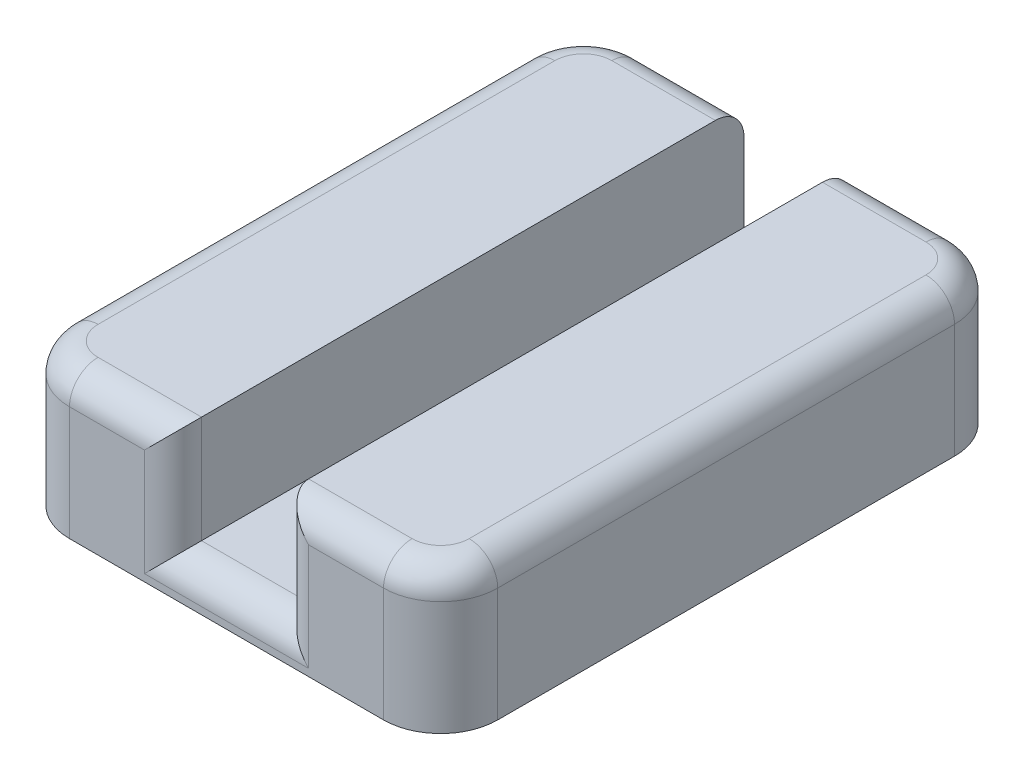
ISO-10303-21;
HEADER;
FILE_DESCRIPTION(('STEP AP214'),'2;1');
FILE_NAME('part.step','',(''),(''),'','','');
FILE_SCHEMA(('AUTOMOTIVE_DESIGN { 1 0 10303 214 1 1 1 1 }'));
ENDSEC;
DATA;
#1=APPLICATION_CONTEXT('core data for automotive mechanical design processes');
#2=APPLICATION_PROTOCOL_DEFINITION('international standard','automotive_design',2000,#1);
#3=PRODUCT_CONTEXT('',#1,'mechanical');
#4=PRODUCT('Part','Part','',(#3));
#5=PRODUCT_RELATED_PRODUCT_CATEGORY('part','',(#4));
#6=PRODUCT_DEFINITION_FORMATION('','',#4);
#7=PRODUCT_DEFINITION_CONTEXT('part definition',#1,'design');
#8=PRODUCT_DEFINITION('design','',#6,#7);
#9=PRODUCT_DEFINITION_SHAPE('','',#8);
#10=(LENGTH_UNIT() NAMED_UNIT(*) SI_UNIT(.MILLI.,.METRE.));
#11=(NAMED_UNIT(*) PLANE_ANGLE_UNIT() SI_UNIT($,.RADIAN.));
#12=(NAMED_UNIT(*) SI_UNIT($,.STERADIAN.) SOLID_ANGLE_UNIT());
#13=UNCERTAINTY_MEASURE_WITH_UNIT(LENGTH_MEASURE(1.E-05),#10,'distance_accuracy_value','');
#14=(GEOMETRIC_REPRESENTATION_CONTEXT(3) GLOBAL_UNCERTAINTY_ASSIGNED_CONTEXT((#13)) GLOBAL_UNIT_ASSIGNED_CONTEXT((#10,
#11,#12)) REPRESENTATION_CONTEXT('',''));
#15=CARTESIAN_POINT('',(0.,0.,0.));
#16=DIRECTION('',(0.,0.,1.));
#17=DIRECTION('',(1.,0.,0.));
#18=AXIS2_PLACEMENT_3D('',#15,#16,#17);
#19=CARTESIAN_POINT('',(7.14375,6.35,-19.05));
#20=DIRECTION('',(0.,0.,-1.));
#21=DIRECTION('',(-1.,0.,0.));
#22=AXIS2_PLACEMENT_3D('',#19,#20,#21);
#23=PLANE('',#22);
#24=DIRECTION('',(0.,-1.,0.));
#25=VECTOR('',#24,1.);
#26=CARTESIAN_POINT('',(7.14375,6.35,-19.05));
#27=LINE('',#26,#25);
#28=CARTESIAN_POINT('',(7.14375,0.317499999999999,-19.05));
#29=VERTEX_POINT('',#28);
#30=CARTESIAN_POINT('',(7.14375,0.,-19.05));
#31=VERTEX_POINT('',#30);
#32=EDGE_CURVE('E287',#29,#31,#27,.T.);
#33=ORIENTED_EDGE('',*,*,#32,.F.);
#34=DIRECTION('',(-1.,0.,0.));
#35=VECTOR('',#34,1.);
#36=CARTESIAN_POINT('',(7.14375,0.317499999999999,-19.05));
#37=LINE('',#36,#35);
#38=CARTESIAN_POINT('',(11.90625,0.317499999999999,-19.05));
#39=VERTEX_POINT('',#38);
#40=EDGE_CURVE('E383',#29,#39,#37,.F.);
#41=ORIENTED_EDGE('',*,*,#40,.T.);
#42=DIRECTION('',(0.,-1.,0.));
#43=VECTOR('',#42,1.);
#44=CARTESIAN_POINT('',(11.90625,6.35,-19.05));
#45=LINE('',#44,#43);
#46=CARTESIAN_POINT('',(11.90625,0.,-19.05));
#47=VERTEX_POINT('',#46);
#48=EDGE_CURVE('E284',#39,#47,#45,.T.);
#49=ORIENTED_EDGE('',*,*,#48,.T.);
#50=DIRECTION('',(1.,0.,0.));
#51=VECTOR('',#50,1.);
#52=CARTESIAN_POINT('',(7.14375,0.,-19.05));
#53=LINE('',#52,#51);
#54=EDGE_CURVE('E238',#31,#47,#53,.T.);
#55=ORIENTED_EDGE('',*,*,#54,.F.);
#56=EDGE_LOOP('',(#33,#41,#49,#55));
#57=FACE_BOUND('',#56,.T.);
#58=ADVANCED_FACE('F39',(#57),#23,.T.);
#59=CARTESIAN_POINT('',(2.54,6.35,-2.54));
#60=DIRECTION('',(0.,-1.,0.));
#61=DIRECTION('',(0.,0.,-1.));
#62=AXIS2_PLACEMENT_3D('',#59,#60,#61);
#63=PLANE('',#62);
#64=DIRECTION('',(0.,0.,1.));
#65=VECTOR('',#64,1.);
#66=CARTESIAN_POINT('',(7.14375,6.35,-25.4));
#67=LINE('',#66,#65);
#68=CARTESIAN_POINT('',(7.14375,6.35,-24.13));
#69=VERTEX_POINT('',#68);
#70=CARTESIAN_POINT('',(7.14375,6.35,-1.27000000000001));
#71=VERTEX_POINT('',#70);
#72=EDGE_CURVE('E264',#69,#71,#67,.T.);
#73=ORIENTED_EDGE('',*,*,#72,.F.);
#74=DIRECTION('',(1.,0.,0.));
#75=VECTOR('',#74,1.);
#76=CARTESIAN_POINT('',(2.54,6.35,-24.13));
#77=LINE('',#76,#75);
#78=CARTESIAN_POINT('',(2.54,6.35,-24.13));
#79=VERTEX_POINT('',#78);
#80=EDGE_CURVE('E352',#69,#79,#77,.F.);
#81=ORIENTED_EDGE('',*,*,#80,.T.);
#82=CARTESIAN_POINT('',(2.54,6.35,-22.86));
#83=DIRECTION('',(0.,-1.,0.));
#84=DIRECTION('',(0.,0.,-1.));
#85=AXIS2_PLACEMENT_3D('',#82,#83,#84);
#86=CIRCLE('',#85,1.27);
#87=CARTESIAN_POINT('',(1.27,6.35,-22.86));
#88=VERTEX_POINT('',#87);
#89=EDGE_CURVE('E349',#79,#88,#86,.F.);
#90=ORIENTED_EDGE('',*,*,#89,.T.);
#91=DIRECTION('',(0.,0.,-1.));
#92=VECTOR('',#91,1.);
#93=CARTESIAN_POINT('',(1.27,6.35,-2.54000000000002));
#94=LINE('',#93,#92);
#95=CARTESIAN_POINT('',(1.27,6.35,-2.54000000000002));
#96=VERTEX_POINT('',#95);
#97=EDGE_CURVE('E346',#88,#96,#94,.F.);
#98=ORIENTED_EDGE('',*,*,#97,.T.);
#99=CARTESIAN_POINT('',(2.54,6.35,-2.54));
#100=DIRECTION('',(0.,-1.,0.));
#101=DIRECTION('',(0.,0.,-1.));
#102=AXIS2_PLACEMENT_3D('',#99,#100,#101);
#103=CIRCLE('',#102,1.27);
#104=CARTESIAN_POINT('',(2.54000000000001,6.35,-1.27));
#105=VERTEX_POINT('',#104);
#106=EDGE_CURVE('E343',#96,#105,#103,.F.);
#107=ORIENTED_EDGE('',*,*,#106,.T.);
#108=DIRECTION('',(1.,0.,0.));
#109=VECTOR('',#108,1.);
#110=CARTESIAN_POINT('',(2.54,6.35,-1.27));
#111=LINE('',#110,#109);
#112=EDGE_CURVE('E340',#105,#71,#111,.T.);
#113=ORIENTED_EDGE('',*,*,#112,.T.);
#114=EDGE_LOOP('',(#73,#81,#90,#98,#107,#113));
#115=FACE_BOUND('',#114,.T.);
#116=ADVANCED_FACE('F528',(#115),#63,.F.);
#117=CARTESIAN_POINT('',(2.54,6.35,-2.54));
#118=DIRECTION('',(0.,-1.,0.));
#119=DIRECTION('',(0.,0.,-1.));
#120=AXIS2_PLACEMENT_3D('',#117,#118,#119);
#121=CYLINDRICAL_SURFACE('',#120,2.54);
#122=DIRECTION('',(0.,-1.,0.));
#123=VECTOR('',#122,1.);
#124=CARTESIAN_POINT('',(2.54000000000002,6.35,0.));
#125=LINE('',#124,#123);
#126=CARTESIAN_POINT('',(2.54000000000002,5.08,0.));
#127=VERTEX_POINT('',#126);
#128=CARTESIAN_POINT('',(2.54000000000002,0.,0.));
#129=VERTEX_POINT('',#128);
#130=EDGE_CURVE('E265',#127,#129,#125,.T.);
#131=ORIENTED_EDGE('',*,*,#130,.F.);
#132=CARTESIAN_POINT('',(2.54,5.08,-2.54));
#133=DIRECTION('',(0.,-1.,0.));
#134=DIRECTION('',(0.,0.,-1.));
#135=AXIS2_PLACEMENT_3D('',#132,#133,#134);
#136=CIRCLE('',#135,2.54);
#137=CARTESIAN_POINT('',(0.,5.08,-2.54000000000002));
#138=VERTEX_POINT('',#137);
#139=EDGE_CURVE('E196',#127,#138,#136,.T.);
#140=ORIENTED_EDGE('',*,*,#139,.T.);
#141=DIRECTION('',(0.,-1.,0.));
#142=VECTOR('',#141,1.);
#143=CARTESIAN_POINT('',(0.,6.35,-2.54000000000002));
#144=LINE('',#143,#142);
#145=CARTESIAN_POINT('',(0.,0.,-2.54000000000002));
#146=VERTEX_POINT('',#145);
#147=EDGE_CURVE('E189',#138,#146,#144,.T.);
#148=ORIENTED_EDGE('',*,*,#147,.T.);
#149=CARTESIAN_POINT('',(2.54,0.,-2.54));
#150=DIRECTION('',(0.,-1.,0.));
#151=DIRECTION('',(0.,0.,-1.));
#152=AXIS2_PLACEMENT_3D('',#149,#150,#151);
#153=CIRCLE('',#152,2.54);
#154=EDGE_CURVE('E194',#129,#146,#153,.T.);
#155=ORIENTED_EDGE('',*,*,#154,.F.);
#156=EDGE_LOOP('',(#131,#140,#148,#155));
#157=FACE_BOUND('',#156,.T.);
#158=ADVANCED_FACE('F192',(#157),#121,.T.);
#159=CARTESIAN_POINT('',(2.54000000000002,6.35,0.));
#160=DIRECTION('',(0.,0.,-1.));
#161=DIRECTION('',(-1.,0.,0.));
#162=AXIS2_PLACEMENT_3D('',#159,#160,#161);
#163=PLANE('',#162);
#164=DIRECTION('',(0.,-1.,0.));
#165=VECTOR('',#164,1.);
#166=CARTESIAN_POINT('',(16.51,6.35,0.));
#167=LINE('',#166,#165);
#168=CARTESIAN_POINT('',(16.51,5.08,0.));
#169=VERTEX_POINT('',#168);
#170=CARTESIAN_POINT('',(16.51,0.,0.));
#171=VERTEX_POINT('',#170);
#172=EDGE_CURVE('E269',#169,#171,#167,.T.);
#173=ORIENTED_EDGE('',*,*,#172,.F.);
#174=DIRECTION('',(1.,0.,0.));
#175=VECTOR('',#174,1.);
#176=CARTESIAN_POINT('',(2.54000000000002,5.08,0.));
#177=LINE('',#176,#175);
#178=CARTESIAN_POINT('',(13.17625,5.08,0.));
#179=VERTEX_POINT('',#178);
#180=EDGE_CURVE('E57',#169,#179,#177,.F.);
#181=ORIENTED_EDGE('',*,*,#180,.T.);
#182=DIRECTION('',(0.,1.,0.));
#183=VECTOR('',#182,1.);
#184=CARTESIAN_POINT('',(13.17625,6.35,0.));
#185=LINE('',#184,#183);
#186=CARTESIAN_POINT('',(13.17625,0.317499999999999,0.));
#187=VERTEX_POINT('',#186);
#188=EDGE_CURVE('E61',#179,#187,#185,.F.);
#189=ORIENTED_EDGE('',*,*,#188,.T.);
#190=DIRECTION('',(1.,0.,0.));
#191=VECTOR('',#190,1.);
#192=CARTESIAN_POINT('',(7.14375,0.317499999999999,0.));
#193=LINE('',#192,#191);
#194=CARTESIAN_POINT('',(5.87375,0.317499999999999,0.));
#195=VERTEX_POINT('',#194);
#196=EDGE_CURVE('E376',#187,#195,#193,.F.);
#197=ORIENTED_EDGE('',*,*,#196,.T.);
#198=DIRECTION('',(0.,1.,0.));
#199=VECTOR('',#198,1.);
#200=CARTESIAN_POINT('',(5.87375,6.35,0.));
#201=LINE('',#200,#199);
#202=CARTESIAN_POINT('',(5.87375,5.08,0.));
#203=VERTEX_POINT('',#202);
#204=EDGE_CURVE('E373',#195,#203,#201,.T.);
#205=ORIENTED_EDGE('',*,*,#204,.T.);
#206=DIRECTION('',(1.,0.,0.));
#207=VECTOR('',#206,1.);
#208=CARTESIAN_POINT('',(2.54000000000002,5.08,0.));
#209=LINE('',#208,#207);
#210=EDGE_CURVE('E370',#203,#127,#209,.F.);
#211=ORIENTED_EDGE('',*,*,#210,.T.);
#212=ORIENTED_EDGE('',*,*,#130,.T.);
#213=DIRECTION('',(1.,0.,0.));
#214=VECTOR('',#213,1.);
#215=CARTESIAN_POINT('',(2.54000000000002,0.,0.));
#216=LINE('',#215,#214);
#217=EDGE_CURVE('E217',#129,#171,#216,.T.);
#218=ORIENTED_EDGE('',*,*,#217,.T.);
#219=EDGE_LOOP('',(#173,#181,#189,#197,#205,#211,#212,#218));
#220=FACE_BOUND('',#219,.T.);
#221=ADVANCED_FACE('F512',(#220),#163,.F.);
#222=CARTESIAN_POINT('',(16.51,6.35,-2.54));
#223=DIRECTION('',(0.,-1.,0.));
#224=DIRECTION('',(0.,0.,-1.));
#225=AXIS2_PLACEMENT_3D('',#222,#223,#224);
#226=CYLINDRICAL_SURFACE('',#225,2.54);
#227=DIRECTION('',(0.,-1.,0.));
#228=VECTOR('',#227,1.);
#229=CARTESIAN_POINT('',(19.05,6.35,-2.54000000000002));
#230=LINE('',#229,#228);
#231=CARTESIAN_POINT('',(19.05,5.08,-2.54000000000002));
#232=VERTEX_POINT('',#231);
#233=CARTESIAN_POINT('',(19.05,0.,-2.54000000000002));
#234=VERTEX_POINT('',#233);
#235=EDGE_CURVE('E272',#232,#234,#230,.T.);
#236=ORIENTED_EDGE('',*,*,#235,.F.);
#237=CARTESIAN_POINT('',(16.51,5.08,-2.54));
#238=DIRECTION('',(0.,-1.,0.));
#239=DIRECTION('',(0.,0.,-1.));
#240=AXIS2_PLACEMENT_3D('',#237,#238,#239);
#241=CIRCLE('',#240,2.54);
#242=EDGE_CURVE('E328',#232,#169,#241,.T.);
#243=ORIENTED_EDGE('',*,*,#242,.T.);
#244=ORIENTED_EDGE('',*,*,#172,.T.);
#245=CARTESIAN_POINT('',(16.51,0.,-2.54));
#246=DIRECTION('',(0.,1.,0.));
#247=DIRECTION('',(0.,0.,1.));
#248=AXIS2_PLACEMENT_3D('',#245,#246,#247);
#249=CIRCLE('',#248,2.54);
#250=EDGE_CURVE('E258',#171,#234,#249,.T.);
#251=ORIENTED_EDGE('',*,*,#250,.T.);
#252=EDGE_LOOP('',(#236,#243,#244,#251));
#253=FACE_BOUND('',#252,.T.);
#254=ADVANCED_FACE('F593',(#253),#226,.T.);
#255=CARTESIAN_POINT('',(19.05,6.35,-2.54000000000002));
#256=DIRECTION('',(-1.,0.,0.));
#257=DIRECTION('',(0.,0.,1.));
#258=AXIS2_PLACEMENT_3D('',#255,#256,#257);
#259=PLANE('',#258);
#260=DIRECTION('',(0.,-1.,0.));
#261=VECTOR('',#260,1.);
#262=CARTESIAN_POINT('',(19.05,6.35,-22.86));
#263=LINE('',#262,#261);
#264=CARTESIAN_POINT('',(19.05,5.08,-22.86));
#265=VERTEX_POINT('',#264);
#266=CARTESIAN_POINT('',(19.05,0.,-22.86));
#267=VERTEX_POINT('',#266);
#268=EDGE_CURVE('E275',#265,#267,#263,.T.);
#269=ORIENTED_EDGE('',*,*,#268,.F.);
#270=DIRECTION('',(0.,0.,-1.));
#271=VECTOR('',#270,1.);
#272=CARTESIAN_POINT('',(19.05,5.08,-2.54000000000002));
#273=LINE('',#272,#271);
#274=EDGE_CURVE('E325',#265,#232,#273,.F.);
#275=ORIENTED_EDGE('',*,*,#274,.T.);
#276=ORIENTED_EDGE('',*,*,#235,.T.);
#277=DIRECTION('',(0.,0.,-1.));
#278=VECTOR('',#277,1.);
#279=CARTESIAN_POINT('',(19.05,0.,-2.54000000000002));
#280=LINE('',#279,#278);
#281=EDGE_CURVE('E254',#234,#267,#280,.T.);
#282=ORIENTED_EDGE('',*,*,#281,.T.);
#283=EDGE_LOOP('',(#269,#275,#276,#282));
#284=FACE_BOUND('',#283,.T.);
#285=ADVANCED_FACE('F596',(#284),#259,.F.);
#286=CARTESIAN_POINT('',(16.51,6.35,-22.86));
#287=DIRECTION('',(0.,-1.,0.));
#288=DIRECTION('',(0.,0.,-1.));
#289=AXIS2_PLACEMENT_3D('',#286,#287,#288);
#290=CYLINDRICAL_SURFACE('',#289,2.54);
#291=DIRECTION('',(0.,-1.,0.));
#292=VECTOR('',#291,1.);
#293=CARTESIAN_POINT('',(16.51,6.35,-25.4));
#294=LINE('',#293,#292);
#295=CARTESIAN_POINT('',(16.51,5.08,-25.4));
#296=VERTEX_POINT('',#295);
#297=CARTESIAN_POINT('',(16.51,0.,-25.4));
#298=VERTEX_POINT('',#297);
#299=EDGE_CURVE('E278',#296,#298,#294,.T.);
#300=ORIENTED_EDGE('',*,*,#299,.F.);
#301=CARTESIAN_POINT('',(16.51,5.08,-22.86));
#302=DIRECTION('',(0.,-1.,0.));
#303=DIRECTION('',(0.,0.,-1.));
#304=AXIS2_PLACEMENT_3D('',#301,#302,#303);
#305=CIRCLE('',#304,2.54);
#306=EDGE_CURVE('E322',#296,#265,#305,.T.);
#307=ORIENTED_EDGE('',*,*,#306,.T.);
#308=ORIENTED_EDGE('',*,*,#268,.T.);
#309=CARTESIAN_POINT('',(16.51,0.,-22.86));
#310=DIRECTION('',(0.,-1.,0.));
#311=DIRECTION('',(0.,0.,-1.));
#312=AXIS2_PLACEMENT_3D('',#309,#310,#311);
#313=CIRCLE('',#312,2.54);
#314=EDGE_CURVE('E250',#298,#267,#313,.T.);
#315=ORIENTED_EDGE('',*,*,#314,.F.);
#316=EDGE_LOOP('',(#300,#307,#308,#315));
#317=FACE_BOUND('',#316,.T.);
#318=ADVANCED_FACE('F600',(#317),#290,.T.);
#319=CARTESIAN_POINT('',(11.90625,6.35,-25.4));
#320=DIRECTION('',(0.,0.,-1.));
#321=DIRECTION('',(-1.,0.,0.));
#322=AXIS2_PLACEMENT_3D('',#319,#320,#321);
#323=PLANE('',#322);
#324=DIRECTION('',(0.,-1.,0.));
#325=VECTOR('',#324,1.);
#326=CARTESIAN_POINT('',(11.90625,6.35,-25.4));
#327=LINE('',#326,#325);
#328=CARTESIAN_POINT('',(11.90625,5.08,-25.4));
#329=VERTEX_POINT('',#328);
#330=CARTESIAN_POINT('',(11.90625,0.,-25.4));
#331=VERTEX_POINT('',#330);
#332=EDGE_CURVE('E281',#329,#331,#327,.T.);
#333=ORIENTED_EDGE('',*,*,#332,.F.);
#334=DIRECTION('',(1.,0.,0.));
#335=VECTOR('',#334,1.);
#336=CARTESIAN_POINT('',(16.51,5.08,-25.4));
#337=LINE('',#336,#335);
#338=EDGE_CURVE('E268',#329,#296,#337,.T.);
#339=ORIENTED_EDGE('',*,*,#338,.T.);
#340=ORIENTED_EDGE('',*,*,#299,.T.);
#341=DIRECTION('',(1.,0.,0.));
#342=VECTOR('',#341,1.);
#343=CARTESIAN_POINT('',(11.90625,0.,-25.4));
#344=LINE('',#343,#342);
#345=EDGE_CURVE('E246',#331,#298,#344,.T.);
#346=ORIENTED_EDGE('',*,*,#345,.F.);
#347=EDGE_LOOP('',(#333,#339,#340,#346));
#348=FACE_BOUND('',#347,.T.);
#349=ADVANCED_FACE('F488',(#348),#323,.T.);
#350=CARTESIAN_POINT('',(11.90625,6.35,-25.4));
#351=DIRECTION('',(1.,0.,0.));
#352=DIRECTION('',(0.,0.,-1.));
#353=AXIS2_PLACEMENT_3D('',#350,#351,#352);
#354=PLANE('',#353);
#355=DIRECTION('',(0.,0.,1.));
#356=VECTOR('',#355,1.);
#357=CARTESIAN_POINT('',(11.90625,6.35,-25.4));
#358=LINE('',#357,#356);
#359=CARTESIAN_POINT('',(11.90625,6.35,-24.13));
#360=VERTEX_POINT('',#359);
#361=CARTESIAN_POINT('',(11.90625,6.35,-1.27000000000001));
#362=VERTEX_POINT('',#361);
#363=EDGE_CURVE('E201',#360,#362,#358,.T.);
#364=ORIENTED_EDGE('',*,*,#363,.F.);
#365=CARTESIAN_POINT('',(11.90625,5.08,-24.13));
#366=DIRECTION('',(1.,0.,0.));
#367=DIRECTION('',(0.,0.,-1.));
#368=AXIS2_PLACEMENT_3D('',#365,#366,#367);
#369=CIRCLE('',#368,1.27);
#370=EDGE_CURVE('E319',#360,#329,#369,.F.);
#371=ORIENTED_EDGE('',*,*,#370,.T.);
#372=ORIENTED_EDGE('',*,*,#332,.T.);
#373=DIRECTION('',(0.,0.,1.));
#374=VECTOR('',#373,1.);
#375=CARTESIAN_POINT('',(11.90625,0.,-25.4));
#376=LINE('',#375,#374);
#377=EDGE_CURVE('E242',#331,#47,#376,.T.);
#378=ORIENTED_EDGE('',*,*,#377,.T.);
#379=ORIENTED_EDGE('',*,*,#48,.F.);
#380=CARTESIAN_POINT('',(11.90625,0.317499999999999,-17.78));
#381=DIRECTION('',(1.,0.,0.));
#382=DIRECTION('',(0.,0.,-1.));
#383=AXIS2_PLACEMENT_3D('',#380,#381,#382);
#384=CIRCLE('',#383,1.27);
#385=CARTESIAN_POINT('',(11.90625,1.5875,-17.78));
#386=VERTEX_POINT('',#385);
#387=EDGE_CURVE('E11',#39,#386,#384,.T.);
#388=ORIENTED_EDGE('',*,*,#387,.T.);
#389=DIRECTION('',(0.,0.,-1.));
#390=VECTOR('',#389,1.);
#391=CARTESIAN_POINT('',(11.90625,1.5875,-19.05));
#392=LINE('',#391,#390);
#393=CARTESIAN_POINT('',(11.90625,1.5875,-1.27));
#394=VERTEX_POINT('',#393);
#395=EDGE_CURVE('E219',#394,#386,#392,.T.);
#396=ORIENTED_EDGE('',*,*,#395,.F.);
#397=DIRECTION('',(0.,1.,0.));
#398=VECTOR('',#397,1.);
#399=CARTESIAN_POINT('',(11.90625,6.35,-1.27));
#400=LINE('',#399,#398);
#401=EDGE_CURVE('E316',#394,#362,#400,.T.);
#402=ORIENTED_EDGE('',*,*,#401,.T.);
#403=EDGE_LOOP('',(#364,#371,#372,#378,#379,#388,#396,#402));
#404=FACE_BOUND('',#403,.T.);
#405=ADVANCED_FACE('F484',(#404),#354,.F.);
#406=CARTESIAN_POINT('',(7.14375,6.35,-25.4));
#407=DIRECTION('',(1.,0.,0.));
#408=DIRECTION('',(0.,0.,-1.));
#409=AXIS2_PLACEMENT_3D('',#406,#407,#408);
#410=PLANE('',#409);
#411=DIRECTION('',(0.,-1.,0.));
#412=VECTOR('',#411,1.);
#413=CARTESIAN_POINT('',(7.14375,6.35,-25.4));
#414=LINE('',#413,#412);
#415=CARTESIAN_POINT('',(7.14375,5.08,-25.4));
#416=VERTEX_POINT('',#415);
#417=CARTESIAN_POINT('',(7.14375,0.,-25.4));
#418=VERTEX_POINT('',#417);
#419=EDGE_CURVE('E290',#416,#418,#414,.T.);
#420=ORIENTED_EDGE('',*,*,#419,.F.);
#421=CARTESIAN_POINT('',(7.14375,5.08,-24.13));
#422=DIRECTION('',(1.,0.,0.));
#423=DIRECTION('',(0.,0.,-1.));
#424=AXIS2_PLACEMENT_3D('',#421,#422,#423);
#425=CIRCLE('',#424,1.27);
#426=EDGE_CURVE('E337',#416,#69,#425,.T.);
#427=ORIENTED_EDGE('',*,*,#426,.T.);
#428=ORIENTED_EDGE('',*,*,#72,.T.);
#429=DIRECTION('',(0.,1.,0.));
#430=VECTOR('',#429,1.);
#431=CARTESIAN_POINT('',(7.14375,1.5875,-1.27));
#432=LINE('',#431,#430);
#433=CARTESIAN_POINT('',(7.14375,1.5875,-1.27));
#434=VERTEX_POINT('',#433);
#435=EDGE_CURVE('E334',#71,#434,#432,.F.);
#436=ORIENTED_EDGE('',*,*,#435,.T.);
#437=DIRECTION('',(0.,0.,1.));
#438=VECTOR('',#437,1.);
#439=CARTESIAN_POINT('',(7.14375,1.5875,-19.05));
#440=LINE('',#439,#438);
#441=CARTESIAN_POINT('',(7.14375,1.5875,-17.78));
#442=VERTEX_POINT('',#441);
#443=EDGE_CURVE('E223',#442,#434,#440,.T.);
#444=ORIENTED_EDGE('',*,*,#443,.F.);
#445=CARTESIAN_POINT('',(7.14375,0.317499999999999,-17.78));
#446=DIRECTION('',(1.,0.,0.));
#447=DIRECTION('',(0.,0.,-1.));
#448=AXIS2_PLACEMENT_3D('',#445,#446,#447);
#449=CIRCLE('',#448,1.27);
#450=EDGE_CURVE('E49',#442,#29,#449,.F.);
#451=ORIENTED_EDGE('',*,*,#450,.T.);
#452=ORIENTED_EDGE('',*,*,#32,.T.);
#453=DIRECTION('',(0.,0.,1.));
#454=VECTOR('',#453,1.);
#455=CARTESIAN_POINT('',(7.14375,0.,-25.4));
#456=LINE('',#455,#454);
#457=EDGE_CURVE('E234',#418,#31,#456,.T.);
#458=ORIENTED_EDGE('',*,*,#457,.F.);
#459=EDGE_LOOP('',(#420,#427,#428,#436,#444,#451,#452,#458));
#460=FACE_BOUND('',#459,.T.);
#461=ADVANCED_FACE('F502',(#460),#410,.T.);
#462=CARTESIAN_POINT('',(2.54000000000002,6.35,-25.4));
#463=DIRECTION('',(0.,0.,-1.));
#464=DIRECTION('',(-1.,0.,0.));
#465=AXIS2_PLACEMENT_3D('',#462,#463,#464);
#466=PLANE('',#465);
#467=DIRECTION('',(0.,-1.,0.));
#468=VECTOR('',#467,1.);
#469=CARTESIAN_POINT('',(2.54,6.35,-25.4));
#470=LINE('',#469,#468);
#471=CARTESIAN_POINT('',(2.54,5.08,-25.4));
#472=VERTEX_POINT('',#471);
#473=CARTESIAN_POINT('',(2.54,0.,-25.4));
#474=VERTEX_POINT('',#473);
#475=EDGE_CURVE('E293',#472,#474,#470,.T.);
#476=ORIENTED_EDGE('',*,*,#475,.F.);
#477=DIRECTION('',(1.,0.,0.));
#478=VECTOR('',#477,1.);
#479=CARTESIAN_POINT('',(7.14375,5.08,-25.4));
#480=LINE('',#479,#478);
#481=EDGE_CURVE('E331',#472,#416,#480,.T.);
#482=ORIENTED_EDGE('',*,*,#481,.T.);
#483=ORIENTED_EDGE('',*,*,#419,.T.);
#484=DIRECTION('',(1.,0.,0.));
#485=VECTOR('',#484,1.);
#486=CARTESIAN_POINT('',(2.54000000000002,0.,-25.4));
#487=LINE('',#486,#485);
#488=EDGE_CURVE('E230',#474,#418,#487,.T.);
#489=ORIENTED_EDGE('',*,*,#488,.F.);
#490=EDGE_LOOP('',(#476,#482,#483,#489));
#491=FACE_BOUND('',#490,.T.);
#492=ADVANCED_FACE('F535',(#491),#466,.T.);
#493=CARTESIAN_POINT('',(2.54,6.35,-22.86));
#494=DIRECTION('',(0.,-1.,0.));
#495=DIRECTION('',(0.,0.,-1.));
#496=AXIS2_PLACEMENT_3D('',#493,#494,#495);
#497=CYLINDRICAL_SURFACE('',#496,2.54);
#498=DIRECTION('',(0.,-1.,0.));
#499=VECTOR('',#498,1.);
#500=CARTESIAN_POINT('',(0.,6.35,-22.86));
#501=LINE('',#500,#499);
#502=CARTESIAN_POINT('',(0.,5.08,-22.86));
#503=VERTEX_POINT('',#502);
#504=CARTESIAN_POINT('',(0.,0.,-22.86));
#505=VERTEX_POINT('',#504);
#506=EDGE_CURVE('E200',#503,#505,#501,.T.);
#507=ORIENTED_EDGE('',*,*,#506,.F.);
#508=CARTESIAN_POINT('',(2.54,5.08,-22.86));
#509=DIRECTION('',(0.,-1.,0.));
#510=DIRECTION('',(0.,0.,-1.));
#511=AXIS2_PLACEMENT_3D('',#508,#509,#510);
#512=CIRCLE('',#511,2.54);
#513=EDGE_CURVE('E355',#503,#472,#512,.T.);
#514=ORIENTED_EDGE('',*,*,#513,.T.);
#515=ORIENTED_EDGE('',*,*,#475,.T.);
#516=CARTESIAN_POINT('',(2.54,0.,-22.86));
#517=DIRECTION('',(0.,-1.,0.));
#518=DIRECTION('',(0.,0.,-1.));
#519=AXIS2_PLACEMENT_3D('',#516,#517,#518);
#520=CIRCLE('',#519,2.54);
#521=EDGE_CURVE('E211',#505,#474,#520,.T.);
#522=ORIENTED_EDGE('',*,*,#521,.F.);
#523=EDGE_LOOP('',(#507,#514,#515,#522));
#524=FACE_BOUND('',#523,.T.);
#525=ADVANCED_FACE('F524',(#524),#497,.T.);
#526=CARTESIAN_POINT('',(0.,6.35,-2.54000000000002));
#527=DIRECTION('',(-1.,0.,0.));
#528=DIRECTION('',(0.,0.,1.));
#529=AXIS2_PLACEMENT_3D('',#526,#527,#528);
#530=PLANE('',#529);
#531=ORIENTED_EDGE('',*,*,#147,.F.);
#532=DIRECTION('',(0.,0.,-1.));
#533=VECTOR('',#532,1.);
#534=CARTESIAN_POINT('',(0.,5.08,-22.86));
#535=LINE('',#534,#533);
#536=EDGE_CURVE('E358',#138,#503,#535,.T.);
#537=ORIENTED_EDGE('',*,*,#536,.T.);
#538=ORIENTED_EDGE('',*,*,#506,.T.);
#539=DIRECTION('',(0.,0.,-1.));
#540=VECTOR('',#539,1.);
#541=CARTESIAN_POINT('',(0.,0.,-2.54000000000002));
#542=LINE('',#541,#540);
#543=EDGE_CURVE('E204',#146,#505,#542,.T.);
#544=ORIENTED_EDGE('',*,*,#543,.F.);
#545=EDGE_LOOP('',(#531,#537,#538,#544));
#546=FACE_BOUND('',#545,.T.);
#547=ADVANCED_FACE('F205',(#546),#530,.T.);
#548=CARTESIAN_POINT('',(16.51,6.35,-22.86));
#549=DIRECTION('',(0.,-1.,0.));
#550=DIRECTION('',(0.,0.,-1.));
#551=AXIS2_PLACEMENT_3D('',#548,#549,#550);
#552=CIRCLE('',#551,1.27);
#553=CARTESIAN_POINT('',(17.78,6.35,-22.86));
#554=VERTEX_POINT('',#553);
#555=CARTESIAN_POINT('',(16.51,6.35,-24.13));
#556=VERTEX_POINT('',#555);
#557=EDGE_CURVE('E310',#554,#556,#552,.F.);
#558=ORIENTED_EDGE('',*,*,#557,.T.);
#559=DIRECTION('',(1.,0.,0.));
#560=VECTOR('',#559,1.);
#561=CARTESIAN_POINT('',(11.90625,6.35,-24.13));
#562=LINE('',#561,#560);
#563=EDGE_CURVE('E313',#556,#360,#562,.F.);
#564=ORIENTED_EDGE('',*,*,#563,.T.);
#565=ORIENTED_EDGE('',*,*,#363,.T.);
#566=DIRECTION('',(1.,0.,0.));
#567=VECTOR('',#566,1.);
#568=CARTESIAN_POINT('',(2.54,6.35,-1.27));
#569=LINE('',#568,#567);
#570=CARTESIAN_POINT('',(16.51,6.35,-1.27));
#571=VERTEX_POINT('',#570);
#572=EDGE_CURVE('E301',#362,#571,#569,.T.);
#573=ORIENTED_EDGE('',*,*,#572,.T.);
#574=CARTESIAN_POINT('',(16.51,6.35,-2.54));
#575=DIRECTION('',(0.,-1.,0.));
#576=DIRECTION('',(0.,0.,-1.));
#577=AXIS2_PLACEMENT_3D('',#574,#575,#576);
#578=CIRCLE('',#577,1.27);
#579=CARTESIAN_POINT('',(17.78,6.35,-2.54000000000002));
#580=VERTEX_POINT('',#579);
#581=EDGE_CURVE('E304',#571,#580,#578,.F.);
#582=ORIENTED_EDGE('',*,*,#581,.T.);
#583=DIRECTION('',(0.,0.,-1.));
#584=VECTOR('',#583,1.);
#585=CARTESIAN_POINT('',(17.78,6.35,-2.54));
#586=LINE('',#585,#584);
#587=EDGE_CURVE('E307',#580,#554,#586,.T.);
#588=ORIENTED_EDGE('',*,*,#587,.T.);
#589=EDGE_LOOP('',(#558,#564,#565,#573,#582,#588));
#590=FACE_BOUND('',#589,.T.);
#591=ADVANCED_FACE('F454',(#590),#63,.F.);
#592=CARTESIAN_POINT('',(2.54,0.,-2.54));
#593=DIRECTION('',(0.,-1.,0.));
#594=DIRECTION('',(0.,0.,-1.));
#595=AXIS2_PLACEMENT_3D('',#592,#593,#594);
#596=PLANE('',#595);
#597=ORIENTED_EDGE('',*,*,#154,.T.);
#598=ORIENTED_EDGE('',*,*,#543,.T.);
#599=ORIENTED_EDGE('',*,*,#521,.T.);
#600=ORIENTED_EDGE('',*,*,#488,.T.);
#601=ORIENTED_EDGE('',*,*,#457,.T.);
#602=ORIENTED_EDGE('',*,*,#54,.T.);
#603=ORIENTED_EDGE('',*,*,#377,.F.);
#604=ORIENTED_EDGE('',*,*,#345,.T.);
#605=ORIENTED_EDGE('',*,*,#314,.T.);
#606=ORIENTED_EDGE('',*,*,#281,.F.);
#607=ORIENTED_EDGE('',*,*,#250,.F.);
#608=ORIENTED_EDGE('',*,*,#217,.F.);
#609=EDGE_LOOP('',(#597,#598,#599,#600,#601,#602,#603,#604,#605,#606,#607,#608));
#610=FACE_BOUND('',#609,.T.);
#611=ADVANCED_FACE('F214',(#610),#596,.T.);
#612=CARTESIAN_POINT('',(0.,1.5875,0.));
#613=DIRECTION('',(0.,1.,0.));
#614=DIRECTION('',(0.,0.,1.));
#615=AXIS2_PLACEMENT_3D('',#612,#613,#614);
#616=PLANE('',#615);
#617=ORIENTED_EDGE('',*,*,#443,.T.);
#618=DIRECTION('',(1.,0.,0.));
#619=VECTOR('',#618,1.);
#620=CARTESIAN_POINT('',(11.90625,1.5875,-1.27));
#621=LINE('',#620,#619);
#622=EDGE_CURVE('E367',#434,#394,#621,.T.);
#623=ORIENTED_EDGE('',*,*,#622,.T.);
#624=ORIENTED_EDGE('',*,*,#395,.T.);
#625=DIRECTION('',(-1.,0.,0.));
#626=VECTOR('',#625,1.);
#627=CARTESIAN_POINT('',(0.,1.5875,-17.78));
#628=LINE('',#627,#626);
#629=EDGE_CURVE('E363',#386,#442,#628,.T.);
#630=ORIENTED_EDGE('',*,*,#629,.T.);
#631=EDGE_LOOP('',(#617,#623,#624,#630));
#632=FACE_BOUND('',#631,.T.);
#633=ADVANCED_FACE('F500',(#632),#616,.T.);
#634=CARTESIAN_POINT('',(2.54000000000002,5.08,-24.13));
#635=DIRECTION('',(-1.,0.,0.));
#636=DIRECTION('',(0.,0.,1.));
#637=AXIS2_PLACEMENT_3D('',#634,#635,#636);
#638=CYLINDRICAL_SURFACE('',#637,1.27);
#639=ORIENTED_EDGE('',*,*,#426,.F.);
#640=ORIENTED_EDGE('',*,*,#481,.F.);
#641=CARTESIAN_POINT('',(2.54,5.08,-24.13));
#642=DIRECTION('',(-1.,0.,0.));
#643=DIRECTION('',(0.,0.,1.));
#644=AXIS2_PLACEMENT_3D('',#641,#642,#643);
#645=CIRCLE('',#644,1.27);
#646=EDGE_CURVE('E43',#79,#472,#645,.T.);
#647=ORIENTED_EDGE('',*,*,#646,.F.);
#648=ORIENTED_EDGE('',*,*,#80,.F.);
#649=EDGE_LOOP('',(#639,#640,#647,#648));
#650=FACE_BOUND('',#649,.T.);
#651=ADVANCED_FACE('F533',(#650),#638,.T.);
#652=CARTESIAN_POINT('',(2.54,5.08,-22.86));
#653=DIRECTION('',(0.,-1.,0.));
#654=DIRECTION('',(0.,0.,-1.));
#655=AXIS2_PLACEMENT_3D('',#652,#653,#654);
#656=DEGENERATE_TOROIDAL_SURFACE('',#655,1.27,1.27,.T.);
#657=ORIENTED_EDGE('',*,*,#646,.T.);
#658=ORIENTED_EDGE('',*,*,#513,.F.);
#659=CARTESIAN_POINT('',(1.27,5.08,-22.86));
#660=DIRECTION('',(0.,0.,1.));
#661=DIRECTION('',(1.,0.,0.));
#662=AXIS2_PLACEMENT_3D('',#659,#660,#661);
#663=CIRCLE('',#662,1.27);
#664=EDGE_CURVE('E426',#88,#503,#663,.T.);
#665=ORIENTED_EDGE('',*,*,#664,.F.);
#666=ORIENTED_EDGE('',*,*,#89,.F.);
#667=EDGE_LOOP('',(#657,#658,#665,#666));
#668=FACE_BOUND('',#667,.T.);
#669=ADVANCED_FACE('F526',(#668),#656,.T.);
#670=CARTESIAN_POINT('',(1.27,5.08,-2.54000000000002));
#671=DIRECTION('',(0.,0.,1.));
#672=DIRECTION('',(1.,0.,0.));
#673=AXIS2_PLACEMENT_3D('',#670,#671,#672);
#674=CYLINDRICAL_SURFACE('',#673,1.27);
#675=ORIENTED_EDGE('',*,*,#664,.T.);
#676=ORIENTED_EDGE('',*,*,#536,.F.);
#677=CARTESIAN_POINT('',(1.27,5.08,-2.54000000000002));
#678=DIRECTION('',(0.,0.,1.));
#679=DIRECTION('',(1.,0.,0.));
#680=AXIS2_PLACEMENT_3D('',#677,#678,#679);
#681=CIRCLE('',#680,1.27);
#682=EDGE_CURVE('E423',#96,#138,#681,.T.);
#683=ORIENTED_EDGE('',*,*,#682,.F.);
#684=ORIENTED_EDGE('',*,*,#97,.F.);
#685=EDGE_LOOP('',(#675,#676,#683,#684));
#686=FACE_BOUND('',#685,.T.);
#687=ADVANCED_FACE('F522',(#686),#674,.T.);
#688=CARTESIAN_POINT('',(2.54,5.08,-2.54));
#689=DIRECTION('',(0.,-1.,0.));
#690=DIRECTION('',(0.,0.,-1.));
#691=AXIS2_PLACEMENT_3D('',#688,#689,#690);
#692=DEGENERATE_TOROIDAL_SURFACE('',#691,1.27,1.27,.T.);
#693=ORIENTED_EDGE('',*,*,#682,.T.);
#694=ORIENTED_EDGE('',*,*,#139,.F.);
#695=CARTESIAN_POINT('',(2.54000000000001,5.08,-1.27));
#696=DIRECTION('',(1.,0.,0.));
#697=DIRECTION('',(0.,0.,-1.));
#698=AXIS2_PLACEMENT_3D('',#695,#696,#697);
#699=CIRCLE('',#698,1.27);
#700=EDGE_CURVE('E419',#105,#127,#699,.T.);
#701=ORIENTED_EDGE('',*,*,#700,.F.);
#702=ORIENTED_EDGE('',*,*,#106,.F.);
#703=EDGE_LOOP('',(#693,#694,#701,#702));
#704=FACE_BOUND('',#703,.T.);
#705=ADVANCED_FACE('F520',(#704),#692,.T.);
#706=CARTESIAN_POINT('',(2.54,5.08,-1.27));
#707=DIRECTION('',(1.,0.,0.));
#708=DIRECTION('',(0.,0.,-1.));
#709=AXIS2_PLACEMENT_3D('',#706,#707,#708);
#710=CYLINDRICAL_SURFACE('',#709,1.27);
#711=ORIENTED_EDGE('',*,*,#700,.T.);
#712=ORIENTED_EDGE('',*,*,#210,.F.);
#713=CARTESIAN_POINT('',(5.87375,5.08,-1.27));
#714=DIRECTION('',(0.707106781186547,-0.707106781186547,0.));
#715=DIRECTION('',(0.707106781186547,0.707106781186547,0.));
#716=AXIS2_PLACEMENT_3D('',#713,#714,#715);
#717=ELLIPSE('',#716,1.79605122421383,1.27);
#718=EDGE_CURVE('E415',#71,#203,#717,.T.);
#719=ORIENTED_EDGE('',*,*,#718,.F.);
#720=ORIENTED_EDGE('',*,*,#112,.F.);
#721=EDGE_LOOP('',(#711,#712,#719,#720));
#722=FACE_BOUND('',#721,.T.);
#723=ADVANCED_FACE('F515',(#722),#710,.T.);
#724=CARTESIAN_POINT('',(5.87375,6.35,-1.27));
#725=DIRECTION('',(0.,-1.,0.));
#726=DIRECTION('',(0.,0.,-1.));
#727=AXIS2_PLACEMENT_3D('',#724,#725,#726);
#728=CYLINDRICAL_SURFACE('',#727,1.27);
#729=ORIENTED_EDGE('',*,*,#718,.T.);
#730=ORIENTED_EDGE('',*,*,#204,.F.);
#731=CARTESIAN_POINT('',(5.87375,0.317499999999999,-1.27));
#732=DIRECTION('',(-0.707106781186547,0.707106781186547,0.));
#733=DIRECTION('',(-0.707106781186547,-0.707106781186547,0.));
#734=AXIS2_PLACEMENT_3D('',#731,#732,#733);
#735=ELLIPSE('',#734,1.79605122421383,1.27);
#736=EDGE_CURVE('E411',#434,#195,#735,.F.);
#737=ORIENTED_EDGE('',*,*,#736,.F.);
#738=ORIENTED_EDGE('',*,*,#435,.F.);
#739=EDGE_LOOP('',(#729,#730,#737,#738));
#740=FACE_BOUND('',#739,.T.);
#741=ADVANCED_FACE('F506',(#740),#728,.T.);
#742=CARTESIAN_POINT('',(0.,0.317499999999999,-1.27));
#743=DIRECTION('',(-1.,0.,0.));
#744=DIRECTION('',(0.,0.,1.));
#745=AXIS2_PLACEMENT_3D('',#742,#743,#744);
#746=CYLINDRICAL_SURFACE('',#745,1.27);
#747=ORIENTED_EDGE('',*,*,#736,.T.);
#748=ORIENTED_EDGE('',*,*,#196,.F.);
#749=CARTESIAN_POINT('',(13.17625,0.317499999999999,-1.27));
#750=DIRECTION('',(-0.707106781186547,-0.707106781186547,0.));
#751=DIRECTION('',(-0.707106781186547,0.707106781186547,0.));
#752=AXIS2_PLACEMENT_3D('',#749,#750,#751);
#753=ELLIPSE('',#752,1.79605122421383,1.27);
#754=EDGE_CURVE('E407',#394,#187,#753,.F.);
#755=ORIENTED_EDGE('',*,*,#754,.F.);
#756=ORIENTED_EDGE('',*,*,#622,.F.);
#757=EDGE_LOOP('',(#747,#748,#755,#756));
#758=FACE_BOUND('',#757,.T.);
#759=ADVANCED_FACE('F511',(#758),#746,.T.);
#760=CARTESIAN_POINT('',(13.17625,6.35,-1.27));
#761=DIRECTION('',(0.,1.,0.));
#762=DIRECTION('',(0.,0.,1.));
#763=AXIS2_PLACEMENT_3D('',#760,#761,#762);
#764=CYLINDRICAL_SURFACE('',#763,1.27);
#765=ORIENTED_EDGE('',*,*,#754,.T.);
#766=ORIENTED_EDGE('',*,*,#188,.F.);
#767=CARTESIAN_POINT('',(13.17625,5.08,-1.27));
#768=DIRECTION('',(0.707106781186547,0.707106781186547,0.));
#769=DIRECTION('',(-0.707106781186547,0.707106781186547,0.));
#770=AXIS2_PLACEMENT_3D('',#767,#768,#769);
#771=ELLIPSE('',#770,1.79605122421383,1.27);
#772=EDGE_CURVE('E403',#362,#179,#771,.T.);
#773=ORIENTED_EDGE('',*,*,#772,.F.);
#774=ORIENTED_EDGE('',*,*,#401,.F.);
#775=EDGE_LOOP('',(#765,#766,#773,#774));
#776=FACE_BOUND('',#775,.T.);
#777=ADVANCED_FACE('F462',(#776),#764,.T.);
#778=CARTESIAN_POINT('',(2.54,5.08,-1.27));
#779=DIRECTION('',(1.,0.,0.));
#780=DIRECTION('',(0.,0.,-1.));
#781=AXIS2_PLACEMENT_3D('',#778,#779,#780);
#782=CYLINDRICAL_SURFACE('',#781,1.27);
#783=ORIENTED_EDGE('',*,*,#772,.T.);
#784=ORIENTED_EDGE('',*,*,#180,.F.);
#785=CARTESIAN_POINT('',(16.51,5.08,-1.27));
#786=DIRECTION('',(1.,0.,0.));
#787=DIRECTION('',(0.,0.,-1.));
#788=AXIS2_PLACEMENT_3D('',#785,#786,#787);
#789=CIRCLE('',#788,1.27);
#790=EDGE_CURVE('E399',#571,#169,#789,.T.);
#791=ORIENTED_EDGE('',*,*,#790,.F.);
#792=ORIENTED_EDGE('',*,*,#572,.F.);
#793=EDGE_LOOP('',(#783,#784,#791,#792));
#794=FACE_BOUND('',#793,.T.);
#795=ADVANCED_FACE('F464',(#794),#782,.T.);
#796=CARTESIAN_POINT('',(16.51,5.08,-2.54));
#797=DIRECTION('',(0.,-1.,0.));
#798=DIRECTION('',(0.,0.,-1.));
#799=AXIS2_PLACEMENT_3D('',#796,#797,#798);
#800=TOROIDAL_SURFACE('',#799,1.27,1.27);
#801=ORIENTED_EDGE('',*,*,#790,.T.);
#802=ORIENTED_EDGE('',*,*,#242,.F.);
#803=CARTESIAN_POINT('',(17.78,5.08,-2.54000000000002));
#804=DIRECTION('',(0.,0.,-1.));
#805=DIRECTION('',(-1.,0.,0.));
#806=AXIS2_PLACEMENT_3D('',#803,#804,#805);
#807=CIRCLE('',#806,1.27);
#808=EDGE_CURVE('E395',#580,#232,#807,.T.);
#809=ORIENTED_EDGE('',*,*,#808,.F.);
#810=ORIENTED_EDGE('',*,*,#581,.F.);
#811=EDGE_LOOP('',(#801,#802,#809,#810));
#812=FACE_BOUND('',#811,.T.);
#813=ADVANCED_FACE('F469',(#812),#800,.T.);
#814=CARTESIAN_POINT('',(17.78,5.08,-2.54));
#815=DIRECTION('',(0.,0.,-1.));
#816=DIRECTION('',(-1.,0.,0.));
#817=AXIS2_PLACEMENT_3D('',#814,#815,#816);
#818=CYLINDRICAL_SURFACE('',#817,1.27);
#819=ORIENTED_EDGE('',*,*,#808,.T.);
#820=ORIENTED_EDGE('',*,*,#274,.F.);
#821=CARTESIAN_POINT('',(17.78,5.08,-22.86));
#822=DIRECTION('',(0.,0.,-1.));
#823=DIRECTION('',(-1.,0.,0.));
#824=AXIS2_PLACEMENT_3D('',#821,#822,#823);
#825=CIRCLE('',#824,1.27);
#826=EDGE_CURVE('E391',#554,#265,#825,.T.);
#827=ORIENTED_EDGE('',*,*,#826,.F.);
#828=ORIENTED_EDGE('',*,*,#587,.F.);
#829=EDGE_LOOP('',(#819,#820,#827,#828));
#830=FACE_BOUND('',#829,.T.);
#831=ADVANCED_FACE('F475',(#830),#818,.T.);
#832=CARTESIAN_POINT('',(16.51,5.08,-22.86));
#833=DIRECTION('',(0.,-1.,0.));
#834=DIRECTION('',(0.,0.,-1.));
#835=AXIS2_PLACEMENT_3D('',#832,#833,#834);
#836=TOROIDAL_SURFACE('',#835,1.27,1.27);
#837=ORIENTED_EDGE('',*,*,#826,.T.);
#838=ORIENTED_EDGE('',*,*,#306,.F.);
#839=CARTESIAN_POINT('',(16.51,5.08,-24.13));
#840=DIRECTION('',(-1.,0.,0.));
#841=DIRECTION('',(0.,0.,1.));
#842=AXIS2_PLACEMENT_3D('',#839,#840,#841);
#843=CIRCLE('',#842,1.27);
#844=EDGE_CURVE('E388',#556,#296,#843,.T.);
#845=ORIENTED_EDGE('',*,*,#844,.F.);
#846=ORIENTED_EDGE('',*,*,#557,.F.);
#847=EDGE_LOOP('',(#837,#838,#845,#846));
#848=FACE_BOUND('',#847,.T.);
#849=ADVANCED_FACE('F479',(#848),#836,.T.);
#850=CARTESIAN_POINT('',(11.90625,5.08,-24.13));
#851=DIRECTION('',(-1.,0.,0.));
#852=DIRECTION('',(0.,0.,1.));
#853=AXIS2_PLACEMENT_3D('',#850,#851,#852);
#854=CYLINDRICAL_SURFACE('',#853,1.27);
#855=ORIENTED_EDGE('',*,*,#370,.F.);
#856=ORIENTED_EDGE('',*,*,#563,.F.);
#857=ORIENTED_EDGE('',*,*,#844,.T.);
#858=ORIENTED_EDGE('',*,*,#338,.F.);
#859=EDGE_LOOP('',(#855,#856,#857,#858));
#860=FACE_BOUND('',#859,.T.);
#861=ADVANCED_FACE('F482',(#860),#854,.T.);
#862=CARTESIAN_POINT('',(0.,0.317499999999999,-17.78));
#863=DIRECTION('',(-1.,0.,0.));
#864=DIRECTION('',(0.,0.,1.));
#865=AXIS2_PLACEMENT_3D('',#862,#863,#864);
#866=CYLINDRICAL_SURFACE('',#865,1.27);
#867=ORIENTED_EDGE('',*,*,#387,.F.);
#868=ORIENTED_EDGE('',*,*,#40,.F.);
#869=ORIENTED_EDGE('',*,*,#450,.F.);
#870=ORIENTED_EDGE('',*,*,#629,.F.);
#871=EDGE_LOOP('',(#867,#868,#869,#870));
#872=FACE_BOUND('',#871,.T.);
#873=ADVANCED_FACE('F41',(#872),#866,.T.);
#874=CLOSED_SHELL('',(#58,#116,#158,#221,#254,#285,#318,#349,#405,#461,#492,#525,#547,#591,#611,
#633,#651,#669,#687,#705,#723,#741,#759,#777,#795,#813,#831,#849,#861,#873));
#875=MANIFOLD_SOLID_BREP('B2',#874);
#876=ADVANCED_BREP_SHAPE_REPRESENTATION('',(#18,#875),#14);
#877=SHAPE_DEFINITION_REPRESENTATION(#9,#876);
ENDSEC;
END-ISO-10303-21;
